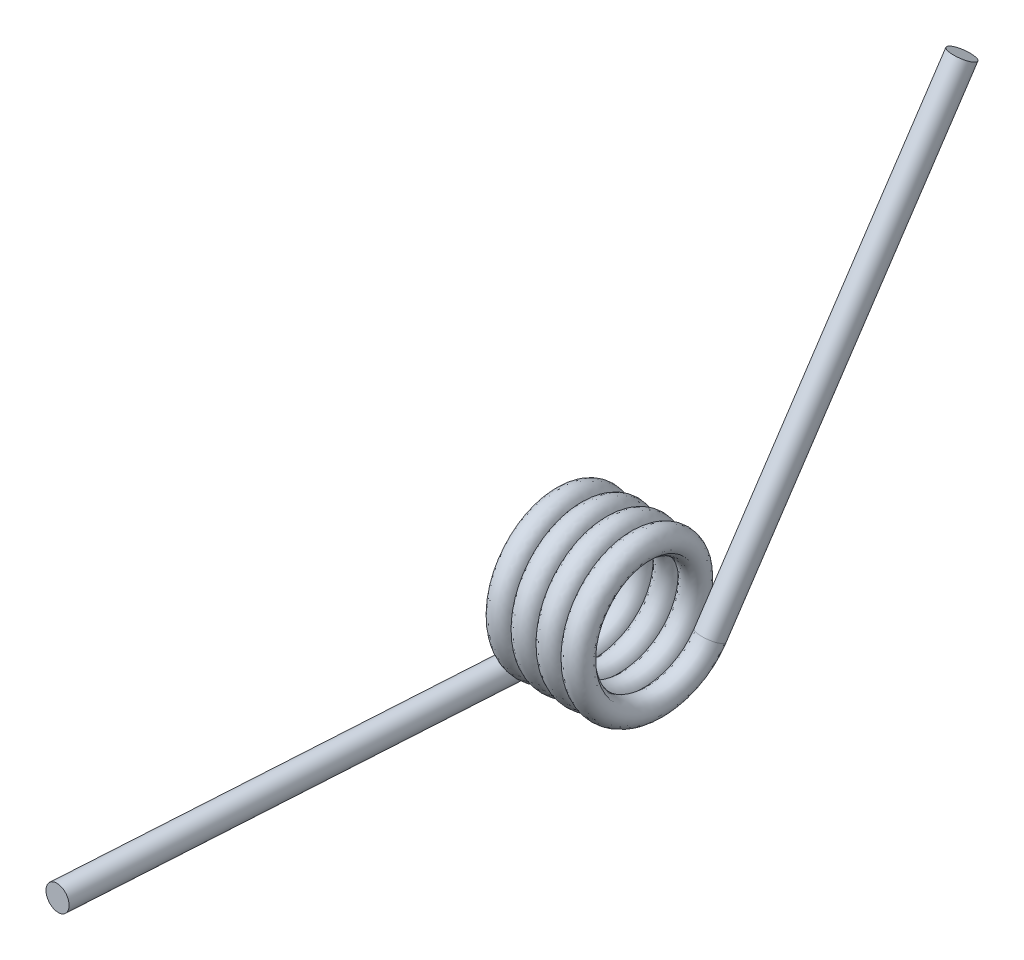
ISO-10303-21;
HEADER;
FILE_DESCRIPTION(('STEP AP214'),'2;1');
FILE_NAME('part.step','',(''),(''),'','','');
FILE_SCHEMA(('AUTOMOTIVE_DESIGN { 1 0 10303 214 1 1 1 1 }'));
ENDSEC;
DATA;
#1=APPLICATION_CONTEXT('core data for automotive mechanical design processes');
#2=APPLICATION_PROTOCOL_DEFINITION('international standard','automotive_design',2000,#1);
#3=PRODUCT_CONTEXT('',#1,'mechanical');
#4=PRODUCT('Part','Part','',(#3));
#5=PRODUCT_RELATED_PRODUCT_CATEGORY('part','',(#4));
#6=PRODUCT_DEFINITION_FORMATION('','',#4);
#7=PRODUCT_DEFINITION_CONTEXT('part definition',#1,'design');
#8=PRODUCT_DEFINITION('design','',#6,#7);
#9=PRODUCT_DEFINITION_SHAPE('','',#8);
#10=(LENGTH_UNIT() NAMED_UNIT(*) SI_UNIT(.MILLI.,.METRE.));
#11=(NAMED_UNIT(*) PLANE_ANGLE_UNIT() SI_UNIT($,.RADIAN.));
#12=(NAMED_UNIT(*) SI_UNIT($,.STERADIAN.) SOLID_ANGLE_UNIT());
#13=UNCERTAINTY_MEASURE_WITH_UNIT(LENGTH_MEASURE(1.E-05),#10,'distance_accuracy_value','');
#14=(GEOMETRIC_REPRESENTATION_CONTEXT(3) GLOBAL_UNCERTAINTY_ASSIGNED_CONTEXT((#13)) GLOBAL_UNIT_ASSIGNED_CONTEXT((#10,
#11,#12)) REPRESENTATION_CONTEXT('',''));
#15=CARTESIAN_POINT('',(0.,0.,0.));
#16=DIRECTION('',(0.,0.,1.));
#17=DIRECTION('',(1.,0.,0.));
#18=AXIS2_PLACEMENT_3D('',#15,#16,#17);
#19=CARTESIAN_POINT('',(-1.07746324253222,-5.6515,-0.0662813019784811));
#20=CARTESIAN_POINT('',(-0.895429909198887,-5.61323247246049,-3.32917634830365));
#21=CARTESIAN_POINT('',(-0.713396575865554,-2.76834870869073,-4.927483220477));
#22=CARTESIAN_POINT('',(-0.531363242532221,0.0765350550790295,-6.52579009265034));
#23=CARTESIAN_POINT('',(-0.349329909198888,2.88315129130927,-4.86120191849852));
#24=CARTESIAN_POINT('',(-0.167296575865555,5.68976752753952,-3.19661374434669));
#25=CARTESIAN_POINT('',(0.014736757467778,5.6515,0.0662813019784804));
#26=CARTESIAN_POINT('',(0.196770090801111,5.61323247246049,3.32917634830365));
#27=CARTESIAN_POINT('',(0.378803424134444,2.76834870869073,4.927483220477));
#28=CARTESIAN_POINT('',(0.560836757467777,-0.0765350550790287,6.52579009265034));
#29=CARTESIAN_POINT('',(0.74287009080111,-2.88315129130927,4.86120191849852));
#30=CARTESIAN_POINT('',(0.924903424134443,-5.68976752753952,3.19661374434669));
#31=CARTESIAN_POINT('',(1.10693675746778,-5.6515,-0.0662813019784811));
#32=CARTESIAN_POINT('',(1.28897009080111,-5.61323247246049,-3.32917634830365));
#33=CARTESIAN_POINT('',(1.47100342413444,-2.76834870869073,-4.927483220477));
#34=CARTESIAN_POINT('',(1.65303675746777,0.0765350550790295,-6.52579009265034));
#35=CARTESIAN_POINT('',(1.83507009080111,2.88315129130927,-4.86120191849852));
#36=CARTESIAN_POINT('',(2.01710342413444,5.68976752753952,-3.19661374434669));
#37=CARTESIAN_POINT('',(2.19913675746777,5.6515,0.0662813019784804));
#38=CARTESIAN_POINT('',(2.38117009080111,5.61323247246049,3.32917634830365));
#39=CARTESIAN_POINT('',(2.56320342413444,2.76834870869073,4.927483220477));
#40=CARTESIAN_POINT('',(2.74523675746777,-0.0765350550790287,6.52579009265034));
#41=CARTESIAN_POINT('',(2.9272700908011,-2.88315129130927,4.86120191849852));
#42=CARTESIAN_POINT('',(3.10930342413444,-5.68976752753952,3.19661374434669));
#43=CARTESIAN_POINT('',(3.29133675746777,-5.6515,-0.0662813019784811));
#44=CARTESIAN_POINT('',(3.4733700908011,-5.61323247246049,-3.32917634830365));
#45=CARTESIAN_POINT('',(3.65540342413444,-2.76834870869073,-4.927483220477));
#46=CARTESIAN_POINT('',(3.83743675746777,0.0765350550790295,-6.52579009265034));
#47=CARTESIAN_POINT('',(4.0194700908011,2.88315129130927,-4.86120191849852));
#48=CARTESIAN_POINT('',(4.20150342413443,5.68976752753952,-3.19661374434669));
#49=CARTESIAN_POINT('',(4.38353675746777,5.6515,0.0662813019784804));
#50=CARTESIAN_POINT('',(4.5655700908011,5.61323247246049,3.32917634830365));
#51=CARTESIAN_POINT('',(4.74760342413443,2.76834870869073,4.927483220477));
#52=CARTESIAN_POINT('',(4.92963675746777,-0.0765350550790287,6.52579009265034));
#53=CARTESIAN_POINT('',(5.1116700908011,-2.88315129130927,4.86120191849852));
#54=CARTESIAN_POINT('',(5.29370342413443,-5.68976752753952,3.19661374434669));
#55=CARTESIAN_POINT('',(5.47573675746777,-5.6515,-0.0662813019784811));
#56=CARTESIAN_POINT('',(5.6577700908011,-5.61323247246049,-3.32917634830365));
#57=CARTESIAN_POINT('',(5.83980342413443,-2.76834870869073,-4.927483220477));
#58=CARTESIAN_POINT('',(6.02183675746776,0.0765350550790295,-6.52579009265034));
#59=CARTESIAN_POINT('',(6.2038700908011,2.88315129130927,-4.86120191849852));
#60=CARTESIAN_POINT('',(6.38590342413443,5.68976752753952,-3.19661374434669));
#61=CARTESIAN_POINT('',(6.56793675746776,5.6515,0.0662813019784804));
#62=CARTESIAN_POINT('',(6.7499700908011,5.61323247246049,3.32917634830365));
#63=CARTESIAN_POINT('',(6.93200342413443,2.76834870869073,4.927483220477));
#64=CARTESIAN_POINT('',(7.11403675746776,-0.0765350550790287,6.52579009265034));
#65=CARTESIAN_POINT('',(7.29607009080109,-2.88315129130927,4.86120191849852));
#66=CARTESIAN_POINT('',(7.47810342413443,-5.68976752753952,3.19661374434669));
#67=CARTESIAN_POINT('',(7.66013675746776,-5.6515,-0.0662813019784811));
#68=CARTESIAN_POINT('',(7.84217009080109,-5.61323247246049,-3.32917634830365));
#69=CARTESIAN_POINT('',(8.02420342413443,-2.76834870869073,-4.927483220477));
#70=CARTESIAN_POINT('',(8.20623675746776,0.0765350550790295,-6.52579009265034));
#71=CARTESIAN_POINT('',(8.38827009080109,2.88315129130927,-4.86120191849852));
#72=CARTESIAN_POINT('',(8.57030342413443,5.68976752753952,-3.19661374434669));
#73=CARTESIAN_POINT('',(8.75233675746776,5.6515,0.0662813019784804));
#74=CARTESIAN_POINT('',(8.93437009080109,5.61323247246049,3.32917634830365));
#75=CARTESIAN_POINT('',(9.11640342413442,2.76834870869073,4.927483220477));
#76=CARTESIAN_POINT('',(9.29843675746776,-0.0765350550790287,6.52579009265034));
#77=CARTESIAN_POINT('',(9.48047009080109,-2.88315129130927,4.86120191849852));
#78=CARTESIAN_POINT('',(9.66250342413442,-5.68976752753952,3.19661374434669));
#79=CARTESIAN_POINT('',(9.84453675746776,-5.6515,-0.0662813019784811));
#80=CARTESIAN_POINT('',(-1.07746324253222,-3.4925,-0.066281301978456));
#81=CARTESIAN_POINT('',(-0.895429909198888,-3.4542324724605,-2.08267711712322));
#82=CARTESIAN_POINT('',(-0.713396575865555,-1.68884870869075,-3.05773437370638));
#83=CARTESIAN_POINT('',(-0.531363242532222,0.0765350550790006,-4.03279163028954));
#84=CARTESIAN_POINT('',(-0.349329909198889,1.80365129130925,-2.99145307172793));
#85=CARTESIAN_POINT('',(-0.167296575865557,3.5307675275395,-1.95011451316632));
#86=CARTESIAN_POINT('',(0.0147367574677764,3.4925,0.0662813019784555));
#87=CARTESIAN_POINT('',(0.196770090801109,3.4542324724605,2.08267711712322));
#88=CARTESIAN_POINT('',(0.378803424134442,1.68884870869075,3.05773437370638));
#89=CARTESIAN_POINT('',(0.560836757467775,-0.0765350550790001,4.03279163028954));
#90=CARTESIAN_POINT('',(0.742870090801108,-1.80365129130925,2.99145307172793));
#91=CARTESIAN_POINT('',(0.924903424134441,-3.5307675275395,1.95011451316632));
#92=CARTESIAN_POINT('',(1.10693675746777,-3.4925,-0.066281301978456));
#93=CARTESIAN_POINT('',(1.28897009080111,-3.4542324724605,-2.08267711712322));
#94=CARTESIAN_POINT('',(1.47100342413444,-1.68884870869075,-3.05773437370638));
#95=CARTESIAN_POINT('',(1.65303675746777,0.0765350550790006,-4.03279163028954));
#96=CARTESIAN_POINT('',(1.83507009080111,1.80365129130925,-2.99145307172793));
#97=CARTESIAN_POINT('',(2.01710342413444,3.5307675275395,-1.95011451316632));
#98=CARTESIAN_POINT('',(2.19913675746777,3.4925,0.0662813019784555));
#99=CARTESIAN_POINT('',(2.3811700908011,3.4542324724605,2.08267711712322));
#100=CARTESIAN_POINT('',(2.56320342413444,1.68884870869075,3.05773437370638));
#101=CARTESIAN_POINT('',(2.74523675746777,-0.0765350550790001,4.03279163028954));
#102=CARTESIAN_POINT('',(2.9272700908011,-1.80365129130925,2.99145307172793));
#103=CARTESIAN_POINT('',(3.10930342413444,-3.5307675275395,1.95011451316632));
#104=CARTESIAN_POINT('',(3.29133675746777,-3.4925,-0.066281301978456));
#105=CARTESIAN_POINT('',(3.4733700908011,-3.4542324724605,-2.08267711712322));
#106=CARTESIAN_POINT('',(3.65540342413444,-1.68884870869075,-3.05773437370638));
#107=CARTESIAN_POINT('',(3.83743675746777,0.0765350550790006,-4.03279163028954));
#108=CARTESIAN_POINT('',(4.0194700908011,1.80365129130925,-2.99145307172793));
#109=CARTESIAN_POINT('',(4.20150342413443,3.5307675275395,-1.95011451316632));
#110=CARTESIAN_POINT('',(4.38353675746777,3.4925,0.0662813019784555));
#111=CARTESIAN_POINT('',(4.5655700908011,3.4542324724605,2.08267711712322));
#112=CARTESIAN_POINT('',(4.74760342413443,1.68884870869075,3.05773437370638));
#113=CARTESIAN_POINT('',(4.92963675746777,-0.0765350550790001,4.03279163028954));
#114=CARTESIAN_POINT('',(5.1116700908011,-1.80365129130925,2.99145307172793));
#115=CARTESIAN_POINT('',(5.29370342413443,-3.5307675275395,1.95011451316632));
#116=CARTESIAN_POINT('',(5.47573675746776,-3.4925,-0.066281301978456));
#117=CARTESIAN_POINT('',(5.6577700908011,-3.4542324724605,-2.08267711712322));
#118=CARTESIAN_POINT('',(5.83980342413443,-1.68884870869075,-3.05773437370638));
#119=CARTESIAN_POINT('',(6.02183675746776,0.0765350550790006,-4.03279163028954));
#120=CARTESIAN_POINT('',(6.2038700908011,1.80365129130925,-2.99145307172793));
#121=CARTESIAN_POINT('',(6.38590342413443,3.5307675275395,-1.95011451316632));
#122=CARTESIAN_POINT('',(6.56793675746776,3.4925,0.0662813019784555));
#123=CARTESIAN_POINT('',(6.74997009080109,3.4542324724605,2.08267711712322));
#124=CARTESIAN_POINT('',(6.93200342413443,1.68884870869075,3.05773437370638));
#125=CARTESIAN_POINT('',(7.11403675746776,-0.0765350550790001,4.03279163028954));
#126=CARTESIAN_POINT('',(7.29607009080109,-1.80365129130925,2.99145307172793));
#127=CARTESIAN_POINT('',(7.47810342413443,-3.5307675275395,1.95011451316632));
#128=CARTESIAN_POINT('',(7.66013675746776,-3.4925,-0.066281301978456));
#129=CARTESIAN_POINT('',(7.84217009080109,-3.4542324724605,-2.08267711712322));
#130=CARTESIAN_POINT('',(8.02420342413443,-1.68884870869075,-3.05773437370638));
#131=CARTESIAN_POINT('',(8.20623675746776,0.0765350550790006,-4.03279163028954));
#132=CARTESIAN_POINT('',(8.38827009080109,1.80365129130925,-2.99145307172793));
#133=CARTESIAN_POINT('',(8.57030342413442,3.5307675275395,-1.95011451316632));
#134=CARTESIAN_POINT('',(8.75233675746776,3.4925,0.0662813019784555));
#135=CARTESIAN_POINT('',(8.93437009080109,3.4542324724605,2.08267711712322));
#136=CARTESIAN_POINT('',(9.11640342413442,1.68884870869075,3.05773437370638));
#137=CARTESIAN_POINT('',(9.29843675746775,-0.0765350550790001,4.03279163028954));
#138=CARTESIAN_POINT('',(9.48047009080109,-1.80365129130925,2.99145307172793));
#139=CARTESIAN_POINT('',(9.66250342413442,-3.5307675275395,1.95011451316632));
#140=CARTESIAN_POINT('',(9.84453675746775,-3.4925,-0.066281301978456));
#141=CARTESIAN_POINT('',(1.07746324253222,-3.4925,0.0662813019783878));
#142=CARTESIAN_POINT('',(1.25949657586555,-3.53076752753946,-1.95011451316638));
#143=CARTESIAN_POINT('',(1.44152990919888,-1.80365129130919,-2.99145307172796));
#144=CARTESIAN_POINT('',(1.62356324253222,-0.0765350550789224,-4.03279163028954));
#145=CARTESIAN_POINT('',(1.80559657586555,1.68884870869081,-3.05773437370635));
#146=CARTESIAN_POINT('',(1.98762990919888,3.45423247246054,-2.08267711712316));
#147=CARTESIAN_POINT('',(2.16966324253222,3.4925,-0.0662813019783882));
#148=CARTESIAN_POINT('',(2.35169657586555,3.53076752753946,1.95011451316638));
#149=CARTESIAN_POINT('',(2.53372990919888,1.80365129130919,2.99145307172796));
#150=CARTESIAN_POINT('',(2.71576324253221,0.0765350550789229,4.03279163028954));
#151=CARTESIAN_POINT('',(2.89779657586555,-1.68884870869081,3.05773437370635));
#152=CARTESIAN_POINT('',(3.07982990919888,-3.45423247246054,2.08267711712316));
#153=CARTESIAN_POINT('',(3.26186324253221,-3.4925,0.0662813019783878));
#154=CARTESIAN_POINT('',(3.44389657586555,-3.53076752753946,-1.95011451316638));
#155=CARTESIAN_POINT('',(3.62592990919888,-1.80365129130919,-2.99145307172796));
#156=CARTESIAN_POINT('',(3.80796324253221,-0.0765350550789224,-4.03279163028954));
#157=CARTESIAN_POINT('',(3.98999657586554,1.68884870869081,-3.05773437370635));
#158=CARTESIAN_POINT('',(4.17202990919888,3.45423247246054,-2.08267711712316));
#159=CARTESIAN_POINT('',(4.35406324253221,3.4925,-0.0662813019783882));
#160=CARTESIAN_POINT('',(4.53609657586554,3.53076752753946,1.95011451316638));
#161=CARTESIAN_POINT('',(4.71812990919888,1.80365129130919,2.99145307172796));
#162=CARTESIAN_POINT('',(4.90016324253221,0.0765350550789229,4.03279163028954));
#163=CARTESIAN_POINT('',(5.08219657586554,-1.68884870869081,3.05773437370635));
#164=CARTESIAN_POINT('',(5.26422990919888,-3.45423247246054,2.08267711712316));
#165=CARTESIAN_POINT('',(5.44626324253221,-3.4925,0.0662813019783878));
#166=CARTESIAN_POINT('',(5.62829657586554,-3.53076752753946,-1.95011451316638));
#167=CARTESIAN_POINT('',(5.81032990919887,-1.80365129130919,-2.99145307172796));
#168=CARTESIAN_POINT('',(5.99236324253221,-0.0765350550789224,-4.03279163028954));
#169=CARTESIAN_POINT('',(6.17439657586554,1.68884870869081,-3.05773437370635));
#170=CARTESIAN_POINT('',(6.35642990919887,3.45423247246054,-2.08267711712316));
#171=CARTESIAN_POINT('',(6.53846324253221,3.4925,-0.0662813019783882));
#172=CARTESIAN_POINT('',(6.72049657586554,3.53076752753946,1.95011451316638));
#173=CARTESIAN_POINT('',(6.90252990919887,1.80365129130919,2.99145307172796));
#174=CARTESIAN_POINT('',(7.08456324253221,0.0765350550789229,4.03279163028954));
#175=CARTESIAN_POINT('',(7.26659657586554,-1.68884870869081,3.05773437370635));
#176=CARTESIAN_POINT('',(7.44862990919887,-3.45423247246054,2.08267711712316));
#177=CARTESIAN_POINT('',(7.6306632425322,-3.4925,0.0662813019783878));
#178=CARTESIAN_POINT('',(7.81269657586554,-3.53076752753946,-1.95011451316638));
#179=CARTESIAN_POINT('',(7.99472990919887,-1.80365129130919,-2.99145307172796));
#180=CARTESIAN_POINT('',(8.1767632425322,-0.0765350550789224,-4.03279163028954));
#181=CARTESIAN_POINT('',(8.35879657586553,1.68884870869081,-3.05773437370635));
#182=CARTESIAN_POINT('',(8.54082990919887,3.45423247246054,-2.08267711712316));
#183=CARTESIAN_POINT('',(8.7228632425322,3.4925,-0.0662813019783882));
#184=CARTESIAN_POINT('',(8.90489657586553,3.53076752753946,1.95011451316638));
#185=CARTESIAN_POINT('',(9.08692990919887,1.80365129130919,2.99145307172796));
#186=CARTESIAN_POINT('',(9.2689632425322,0.0765350550789229,4.03279163028954));
#187=CARTESIAN_POINT('',(9.45099657586553,-1.68884870869081,3.05773437370635));
#188=CARTESIAN_POINT('',(9.63302990919886,-3.45423247246054,2.08267711712316));
#189=CARTESIAN_POINT('',(9.8150632425322,-3.4925,0.0662813019783878));
#190=CARTESIAN_POINT('',(9.99709657586553,-3.53076752753946,-1.95011451316638));
#191=CARTESIAN_POINT('',(10.1791299091989,-1.80365129130919,-2.99145307172796));
#192=CARTESIAN_POINT('',(10.3611632425322,-0.0765350550789224,-4.03279163028954));
#193=CARTESIAN_POINT('',(10.5431965758655,1.68884870869081,-3.05773437370635));
#194=CARTESIAN_POINT('',(10.7252299091989,3.45423247246054,-2.08267711712316));
#195=CARTESIAN_POINT('',(10.9072632425322,3.4925,-0.0662813019783882));
#196=CARTESIAN_POINT('',(11.0892965758655,3.53076752753946,1.95011451316638));
#197=CARTESIAN_POINT('',(11.2713299091989,1.80365129130919,2.99145307172796));
#198=CARTESIAN_POINT('',(11.4533632425322,0.0765350550789229,4.03279163028954));
#199=CARTESIAN_POINT('',(11.6353965758655,-1.68884870869081,3.05773437370635));
#200=CARTESIAN_POINT('',(11.8174299091989,-3.45423247246054,2.08267711712316));
#201=CARTESIAN_POINT('',(11.9994632425322,-3.4925,0.0662813019783878));
#202=CARTESIAN_POINT('',(1.07746324253222,-5.6515,0.0662813019783627));
#203=CARTESIAN_POINT('',(1.25949657586555,-5.68976752753945,-3.19661374434681));
#204=CARTESIAN_POINT('',(1.44152990919889,-2.88315129130917,-4.86120191849858));
#205=CARTESIAN_POINT('',(1.62356324253222,-0.0765350550788935,-6.52579009265034));
#206=CARTESIAN_POINT('',(1.80559657586555,2.76834870869083,-4.92748322047694));
#207=CARTESIAN_POINT('',(1.98762990919888,5.61323247246055,-3.32917634830354));
#208=CARTESIAN_POINT('',(2.16966324253222,5.6515,-0.0662813019783634));
#209=CARTESIAN_POINT('',(2.35169657586555,5.68976752753945,3.19661374434681));
#210=CARTESIAN_POINT('',(2.53372990919888,2.88315129130917,4.86120191849857));
#211=CARTESIAN_POINT('',(2.71576324253222,0.0765350550788943,6.52579009265034));
#212=CARTESIAN_POINT('',(2.89779657586555,-2.76834870869083,4.92748322047694));
#213=CARTESIAN_POINT('',(3.07982990919888,-5.61323247246055,3.32917634830354));
#214=CARTESIAN_POINT('',(3.26186324253222,-5.6515,0.0662813019783627));
#215=CARTESIAN_POINT('',(3.44389657586555,-5.68976752753945,-3.19661374434681));
#216=CARTESIAN_POINT('',(3.62592990919888,-2.88315129130917,-4.86120191849858));
#217=CARTESIAN_POINT('',(3.80796324253221,-0.0765350550788935,-6.52579009265034));
#218=CARTESIAN_POINT('',(3.98999657586555,2.76834870869083,-4.92748322047694));
#219=CARTESIAN_POINT('',(4.17202990919888,5.61323247246055,-3.32917634830354));
#220=CARTESIAN_POINT('',(4.35406324253221,5.6515,-0.0662813019783634));
#221=CARTESIAN_POINT('',(4.53609657586555,5.68976752753945,3.19661374434681));
#222=CARTESIAN_POINT('',(4.71812990919888,2.88315129130917,4.86120191849857));
#223=CARTESIAN_POINT('',(4.90016324253221,0.0765350550788943,6.52579009265034));
#224=CARTESIAN_POINT('',(5.08219657586554,-2.76834870869083,4.92748322047694));
#225=CARTESIAN_POINT('',(5.26422990919888,-5.61323247246055,3.32917634830354));
#226=CARTESIAN_POINT('',(5.44626324253221,-5.6515,0.0662813019783627));
#227=CARTESIAN_POINT('',(5.62829657586554,-5.68976752753945,-3.19661374434681));
#228=CARTESIAN_POINT('',(5.81032990919888,-2.88315129130917,-4.86120191849858));
#229=CARTESIAN_POINT('',(5.99236324253221,-0.0765350550788935,-6.52579009265034));
#230=CARTESIAN_POINT('',(6.17439657586554,2.76834870869083,-4.92748322047694));
#231=CARTESIAN_POINT('',(6.35642990919888,5.61323247246055,-3.32917634830354));
#232=CARTESIAN_POINT('',(6.53846324253221,5.6515,-0.0662813019783634));
#233=CARTESIAN_POINT('',(6.72049657586554,5.68976752753945,3.19661374434681));
#234=CARTESIAN_POINT('',(6.90252990919887,2.88315129130917,4.86120191849857));
#235=CARTESIAN_POINT('',(7.08456324253221,0.0765350550788943,6.52579009265034));
#236=CARTESIAN_POINT('',(7.26659657586554,-2.76834870869083,4.92748322047694));
#237=CARTESIAN_POINT('',(7.44862990919887,-5.61323247246055,3.32917634830354));
#238=CARTESIAN_POINT('',(7.63066324253221,-5.6515,0.0662813019783627));
#239=CARTESIAN_POINT('',(7.81269657586554,-5.68976752753945,-3.19661374434681));
#240=CARTESIAN_POINT('',(7.99472990919887,-2.88315129130917,-4.86120191849858));
#241=CARTESIAN_POINT('',(8.1767632425322,-0.0765350550788935,-6.52579009265034));
#242=CARTESIAN_POINT('',(8.35879657586554,2.76834870869083,-4.92748322047694));
#243=CARTESIAN_POINT('',(8.54082990919887,5.61323247246055,-3.32917634830354));
#244=CARTESIAN_POINT('',(8.7228632425322,5.6515,-0.0662813019783634));
#245=CARTESIAN_POINT('',(8.90489657586554,5.68976752753945,3.19661374434681));
#246=CARTESIAN_POINT('',(9.08692990919887,2.88315129130917,4.86120191849857));
#247=CARTESIAN_POINT('',(9.2689632425322,0.0765350550788943,6.52579009265034));
#248=CARTESIAN_POINT('',(9.45099657586553,-2.76834870869083,4.92748322047694));
#249=CARTESIAN_POINT('',(9.63302990919887,-5.61323247246055,3.32917634830354));
#250=CARTESIAN_POINT('',(9.8150632425322,-5.6515,0.0662813019783627));
#251=CARTESIAN_POINT('',(9.99709657586553,-5.68976752753945,-3.19661374434681));
#252=CARTESIAN_POINT('',(10.1791299091989,-2.88315129130917,-4.86120191849858));
#253=CARTESIAN_POINT('',(10.3611632425322,-0.0765350550788935,-6.52579009265034));
#254=CARTESIAN_POINT('',(10.5431965758655,2.76834870869083,-4.92748322047694));
#255=CARTESIAN_POINT('',(10.7252299091989,5.61323247246055,-3.32917634830354));
#256=CARTESIAN_POINT('',(10.9072632425322,5.6515,-0.0662813019783634));
#257=CARTESIAN_POINT('',(11.0892965758655,5.68976752753945,3.19661374434681));
#258=CARTESIAN_POINT('',(11.2713299091989,2.88315129130917,4.86120191849857));
#259=CARTESIAN_POINT('',(11.4533632425322,0.0765350550788943,6.52579009265034));
#260=CARTESIAN_POINT('',(11.6353965758655,-2.76834870869083,4.92748322047694));
#261=CARTESIAN_POINT('',(11.8174299091989,-5.61323247246055,3.32917634830354));
#262=CARTESIAN_POINT('',(11.9994632425322,-5.6515,0.0662813019783627));
#263=CARTESIAN_POINT('',(1.07746324253222,-7.8105,0.0662813019783376));
#264=CARTESIAN_POINT('',(1.25949657586555,-7.84876752753943,-4.44311297552723));
#265=CARTESIAN_POINT('',(1.44152990919889,-3.96265129130915,-6.73095076526919));
#266=CARTESIAN_POINT('',(1.62356324253222,-0.0765350550788647,-9.01878855501115));
#267=CARTESIAN_POINT('',(1.80559657586555,3.84784870869085,-6.79723206724753));
#268=CARTESIAN_POINT('',(1.98762990919889,7.77223247246057,-4.57567557948391));
#269=CARTESIAN_POINT('',(2.16966324253222,7.8105,-0.0662813019783385));
#270=CARTESIAN_POINT('',(2.35169657586555,7.84876752753943,4.44311297552723));
#271=CARTESIAN_POINT('',(2.53372990919888,3.96265129130915,6.73095076526919));
#272=CARTESIAN_POINT('',(2.71576324253222,0.0765350550788658,9.01878855501115));
#273=CARTESIAN_POINT('',(2.89779657586555,-3.84784870869085,6.79723206724753));
#274=CARTESIAN_POINT('',(3.07982990919888,-7.77223247246057,4.57567557948392));
#275=CARTESIAN_POINT('',(3.26186324253222,-7.8105,0.0662813019783376));
#276=CARTESIAN_POINT('',(3.44389657586555,-7.84876752753943,-4.44311297552723));
#277=CARTESIAN_POINT('',(3.62592990919888,-3.96265129130915,-6.73095076526919));
#278=CARTESIAN_POINT('',(3.80796324253221,-0.0765350550788647,-9.01878855501115));
#279=CARTESIAN_POINT('',(3.98999657586555,3.84784870869085,-6.79723206724753));
#280=CARTESIAN_POINT('',(4.17202990919888,7.77223247246057,-4.57567557948391));
#281=CARTESIAN_POINT('',(4.35406324253221,7.8105,-0.0662813019783385));
#282=CARTESIAN_POINT('',(4.53609657586555,7.84876752753943,4.44311297552723));
#283=CARTESIAN_POINT('',(4.71812990919888,3.96265129130915,6.73095076526919));
#284=CARTESIAN_POINT('',(4.90016324253221,0.0765350550788658,9.01878855501115));
#285=CARTESIAN_POINT('',(5.08219657586555,-3.84784870869085,6.79723206724753));
#286=CARTESIAN_POINT('',(5.26422990919888,-7.77223247246057,4.57567557948392));
#287=CARTESIAN_POINT('',(5.44626324253221,-7.8105,0.0662813019783376));
#288=CARTESIAN_POINT('',(5.62829657586555,-7.84876752753943,-4.44311297552723));
#289=CARTESIAN_POINT('',(5.81032990919888,-3.96265129130915,-6.73095076526919));
#290=CARTESIAN_POINT('',(5.99236324253221,-0.0765350550788647,-9.01878855501115));
#291=CARTESIAN_POINT('',(6.17439657586554,3.84784870869085,-6.79723206724753));
#292=CARTESIAN_POINT('',(6.35642990919888,7.77223247246057,-4.57567557948391));
#293=CARTESIAN_POINT('',(6.53846324253221,7.8105,-0.0662813019783385));
#294=CARTESIAN_POINT('',(6.72049657586554,7.84876752753943,4.44311297552723));
#295=CARTESIAN_POINT('',(6.90252990919887,3.96265129130915,6.73095076526919));
#296=CARTESIAN_POINT('',(7.08456324253221,0.0765350550788658,9.01878855501115));
#297=CARTESIAN_POINT('',(7.26659657586554,-3.84784870869085,6.79723206724753));
#298=CARTESIAN_POINT('',(7.44862990919887,-7.77223247246057,4.57567557948392));
#299=CARTESIAN_POINT('',(7.63066324253221,-7.8105,0.0662813019783376));
#300=CARTESIAN_POINT('',(7.81269657586554,-7.84876752753943,-4.44311297552723));
#301=CARTESIAN_POINT('',(7.99472990919887,-3.96265129130915,-6.73095076526919));
#302=CARTESIAN_POINT('',(8.17676324253221,-0.0765350550788647,-9.01878855501115));
#303=CARTESIAN_POINT('',(8.35879657586554,3.84784870869085,-6.79723206724753));
#304=CARTESIAN_POINT('',(8.54082990919887,7.77223247246057,-4.57567557948391));
#305=CARTESIAN_POINT('',(8.7228632425322,7.8105,-0.0662813019783385));
#306=CARTESIAN_POINT('',(8.90489657586554,7.84876752753943,4.44311297552723));
#307=CARTESIAN_POINT('',(9.08692990919887,3.96265129130915,6.73095076526919));
#308=CARTESIAN_POINT('',(9.2689632425322,0.0765350550788658,9.01878855501115));
#309=CARTESIAN_POINT('',(9.45099657586553,-3.84784870869085,6.79723206724753));
#310=CARTESIAN_POINT('',(9.63302990919887,-7.77223247246057,4.57567557948392));
#311=CARTESIAN_POINT('',(9.8150632425322,-7.8105,0.0662813019783376));
#312=CARTESIAN_POINT('',(9.99709657586553,-7.84876752753943,-4.44311297552723));
#313=CARTESIAN_POINT('',(10.1791299091989,-3.96265129130915,-6.73095076526919));
#314=CARTESIAN_POINT('',(10.3611632425322,-0.0765350550788647,-9.01878855501115));
#315=CARTESIAN_POINT('',(10.5431965758655,3.84784870869085,-6.79723206724753));
#316=CARTESIAN_POINT('',(10.7252299091989,7.77223247246057,-4.57567557948391));
#317=CARTESIAN_POINT('',(10.9072632425322,7.8105,-0.0662813019783385));
#318=CARTESIAN_POINT('',(11.0892965758655,7.84876752753943,4.44311297552723));
#319=CARTESIAN_POINT('',(11.2713299091989,3.96265129130915,6.73095076526919));
#320=CARTESIAN_POINT('',(11.4533632425322,0.0765350550788658,9.01878855501115));
#321=CARTESIAN_POINT('',(11.6353965758655,-3.84784870869085,6.79723206724753));
#322=CARTESIAN_POINT('',(11.8174299091989,-7.77223247246057,4.57567557948392));
#323=CARTESIAN_POINT('',(11.9994632425322,-7.8105,0.0662813019783376));
#324=CARTESIAN_POINT('',(-1.07746324253222,-7.8105,-0.0662813019785062));
#325=CARTESIAN_POINT('',(-0.895429909198885,-7.77223247246047,-4.57567557948408));
#326=CARTESIAN_POINT('',(-0.713396575865552,-3.84784870869071,-6.79723206724761));
#327=CARTESIAN_POINT('',(-0.531363242532219,0.0765350550790583,-9.01878855501115));
#328=CARTESIAN_POINT('',(-0.349329909198886,3.96265129130929,-6.73095076526911));
#329=CARTESIAN_POINT('',(-0.167296575865554,7.84876752753953,-4.44311297552707));
#330=CARTESIAN_POINT('',(0.0147367574677795,7.8105,0.0662813019785052));
#331=CARTESIAN_POINT('',(0.196770090801112,7.77223247246047,4.57567557948408));
#332=CARTESIAN_POINT('',(0.378803424134445,3.84784870869071,6.79723206724761));
#333=CARTESIAN_POINT('',(0.560836757467778,-0.0765350550790572,9.01878855501115));
#334=CARTESIAN_POINT('',(0.742870090801111,-3.96265129130929,6.73095076526911));
#335=CARTESIAN_POINT('',(0.924903424134444,-7.84876752753953,4.44311297552707));
#336=CARTESIAN_POINT('',(1.10693675746778,-7.8105,-0.0662813019785062));
#337=CARTESIAN_POINT('',(1.28897009080111,-7.77223247246047,-4.57567557948408));
#338=CARTESIAN_POINT('',(1.47100342413444,-3.84784870869071,-6.79723206724761));
#339=CARTESIAN_POINT('',(1.65303675746778,0.0765350550790583,-9.01878855501115));
#340=CARTESIAN_POINT('',(1.83507009080111,3.96265129130929,-6.73095076526911));
#341=CARTESIAN_POINT('',(2.01710342413444,7.84876752753953,-4.44311297552707));
#342=CARTESIAN_POINT('',(2.19913675746777,7.8105,0.0662813019785052));
#343=CARTESIAN_POINT('',(2.38117009080111,7.77223247246047,4.57567557948408));
#344=CARTESIAN_POINT('',(2.56320342413444,3.84784870869071,6.79723206724761));
#345=CARTESIAN_POINT('',(2.74523675746777,-0.0765350550790572,9.01878855501115));
#346=CARTESIAN_POINT('',(2.92727009080111,-3.96265129130929,6.73095076526911));
#347=CARTESIAN_POINT('',(3.10930342413444,-7.84876752753953,4.44311297552707));
#348=CARTESIAN_POINT('',(3.29133675746777,-7.8105,-0.0662813019785062));
#349=CARTESIAN_POINT('',(3.47337009080111,-7.77223247246047,-4.57567557948408));
#350=CARTESIAN_POINT('',(3.65540342413444,-3.84784870869071,-6.79723206724761));
#351=CARTESIAN_POINT('',(3.83743675746777,0.0765350550790583,-9.01878855501115));
#352=CARTESIAN_POINT('',(4.0194700908011,3.96265129130929,-6.73095076526911));
#353=CARTESIAN_POINT('',(4.20150342413444,7.84876752753953,-4.44311297552707));
#354=CARTESIAN_POINT('',(4.38353675746777,7.8105,0.0662813019785052));
#355=CARTESIAN_POINT('',(4.5655700908011,7.77223247246047,4.57567557948408));
#356=CARTESIAN_POINT('',(4.74760342413444,3.84784870869071,6.79723206724761));
#357=CARTESIAN_POINT('',(4.92963675746777,-0.0765350550790572,9.01878855501115));
#358=CARTESIAN_POINT('',(5.1116700908011,-3.96265129130929,6.73095076526911));
#359=CARTESIAN_POINT('',(5.29370342413443,-7.84876752753953,4.44311297552707));
#360=CARTESIAN_POINT('',(5.47573675746777,-7.8105,-0.0662813019785062));
#361=CARTESIAN_POINT('',(5.6577700908011,-7.77223247246047,-4.57567557948408));
#362=CARTESIAN_POINT('',(5.83980342413443,-3.84784870869071,-6.79723206724761));
#363=CARTESIAN_POINT('',(6.02183675746777,0.0765350550790583,-9.01878855501115));
#364=CARTESIAN_POINT('',(6.2038700908011,3.96265129130929,-6.73095076526911));
#365=CARTESIAN_POINT('',(6.38590342413443,7.84876752753953,-4.44311297552707));
#366=CARTESIAN_POINT('',(6.56793675746777,7.8105,0.0662813019785052));
#367=CARTESIAN_POINT('',(6.7499700908011,7.77223247246047,4.57567557948408));
#368=CARTESIAN_POINT('',(6.93200342413443,3.84784870869071,6.79723206724761));
#369=CARTESIAN_POINT('',(7.11403675746776,-0.0765350550790572,9.01878855501115));
#370=CARTESIAN_POINT('',(7.2960700908011,-3.96265129130929,6.73095076526911));
#371=CARTESIAN_POINT('',(7.47810342413443,-7.84876752753953,4.44311297552707));
#372=CARTESIAN_POINT('',(7.66013675746776,-7.8105,-0.0662813019785062));
#373=CARTESIAN_POINT('',(7.8421700908011,-7.77223247246047,-4.57567557948408));
#374=CARTESIAN_POINT('',(8.02420342413443,-3.84784870869071,-6.79723206724761));
#375=CARTESIAN_POINT('',(8.20623675746776,0.0765350550790583,-9.01878855501115));
#376=CARTESIAN_POINT('',(8.38827009080109,3.96265129130929,-6.73095076526911));
#377=CARTESIAN_POINT('',(8.57030342413443,7.84876752753953,-4.44311297552707));
#378=CARTESIAN_POINT('',(8.75233675746776,7.8105,0.0662813019785052));
#379=CARTESIAN_POINT('',(8.93437009080109,7.77223247246047,4.57567557948408));
#380=CARTESIAN_POINT('',(9.11640342413442,3.84784870869071,6.79723206724761));
#381=CARTESIAN_POINT('',(9.29843675746776,-0.0765350550790572,9.01878855501115));
#382=CARTESIAN_POINT('',(9.48047009080109,-3.96265129130929,6.73095076526911));
#383=CARTESIAN_POINT('',(9.66250342413442,-7.84876752753953,4.44311297552707));
#384=CARTESIAN_POINT('',(9.84453675746776,-7.8105,-0.0662813019785062));
#385=CARTESIAN_POINT('',(-1.07746324253222,-5.6515,-0.0662813019784811));
#386=CARTESIAN_POINT('',(-0.895429909198887,-5.61323247246049,-3.32917634830365));
#387=CARTESIAN_POINT('',(-0.713396575865554,-2.76834870869073,-4.927483220477));
#388=CARTESIAN_POINT('',(-0.531363242532221,0.0765350550790295,-6.52579009265034));
#389=CARTESIAN_POINT('',(-0.349329909198888,2.88315129130927,-4.86120191849852));
#390=CARTESIAN_POINT('',(-0.167296575865555,5.68976752753952,-3.19661374434669));
#391=CARTESIAN_POINT('',(0.014736757467778,5.6515,0.0662813019784804));
#392=CARTESIAN_POINT('',(0.196770090801111,5.61323247246049,3.32917634830365));
#393=CARTESIAN_POINT('',(0.378803424134444,2.76834870869073,4.927483220477));
#394=CARTESIAN_POINT('',(0.560836757467777,-0.0765350550790287,6.52579009265034));
#395=CARTESIAN_POINT('',(0.74287009080111,-2.88315129130927,4.86120191849852));
#396=CARTESIAN_POINT('',(0.924903424134443,-5.68976752753952,3.19661374434669));
#397=CARTESIAN_POINT('',(1.10693675746778,-5.6515,-0.0662813019784811));
#398=CARTESIAN_POINT('',(1.28897009080111,-5.61323247246049,-3.32917634830365));
#399=CARTESIAN_POINT('',(1.47100342413444,-2.76834870869073,-4.927483220477));
#400=CARTESIAN_POINT('',(1.65303675746777,0.0765350550790295,-6.52579009265034));
#401=CARTESIAN_POINT('',(1.83507009080111,2.88315129130927,-4.86120191849852));
#402=CARTESIAN_POINT('',(2.01710342413444,5.68976752753952,-3.19661374434669));
#403=CARTESIAN_POINT('',(2.19913675746777,5.6515,0.0662813019784804));
#404=CARTESIAN_POINT('',(2.38117009080111,5.61323247246049,3.32917634830365));
#405=CARTESIAN_POINT('',(2.56320342413444,2.76834870869073,4.927483220477));
#406=CARTESIAN_POINT('',(2.74523675746777,-0.0765350550790287,6.52579009265034));
#407=CARTESIAN_POINT('',(2.9272700908011,-2.88315129130927,4.86120191849852));
#408=CARTESIAN_POINT('',(3.10930342413444,-5.68976752753952,3.19661374434669));
#409=CARTESIAN_POINT('',(3.29133675746777,-5.6515,-0.0662813019784811));
#410=CARTESIAN_POINT('',(3.4733700908011,-5.61323247246049,-3.32917634830365));
#411=CARTESIAN_POINT('',(3.65540342413444,-2.76834870869073,-4.927483220477));
#412=CARTESIAN_POINT('',(3.83743675746777,0.0765350550790295,-6.52579009265034));
#413=CARTESIAN_POINT('',(4.0194700908011,2.88315129130927,-4.86120191849852));
#414=CARTESIAN_POINT('',(4.20150342413443,5.68976752753952,-3.19661374434669));
#415=CARTESIAN_POINT('',(4.38353675746777,5.6515,0.0662813019784804));
#416=CARTESIAN_POINT('',(4.5655700908011,5.61323247246049,3.32917634830365));
#417=CARTESIAN_POINT('',(4.74760342413443,2.76834870869073,4.927483220477));
#418=CARTESIAN_POINT('',(4.92963675746777,-0.0765350550790287,6.52579009265034));
#419=CARTESIAN_POINT('',(5.1116700908011,-2.88315129130927,4.86120191849852));
#420=CARTESIAN_POINT('',(5.29370342413443,-5.68976752753952,3.19661374434669));
#421=CARTESIAN_POINT('',(5.47573675746777,-5.6515,-0.0662813019784811));
#422=CARTESIAN_POINT('',(5.6577700908011,-5.61323247246049,-3.32917634830365));
#423=CARTESIAN_POINT('',(5.83980342413443,-2.76834870869073,-4.927483220477));
#424=CARTESIAN_POINT('',(6.02183675746776,0.0765350550790295,-6.52579009265034));
#425=CARTESIAN_POINT('',(6.2038700908011,2.88315129130927,-4.86120191849852));
#426=CARTESIAN_POINT('',(6.38590342413443,5.68976752753952,-3.19661374434669));
#427=CARTESIAN_POINT('',(6.56793675746776,5.6515,0.0662813019784804));
#428=CARTESIAN_POINT('',(6.7499700908011,5.61323247246049,3.32917634830365));
#429=CARTESIAN_POINT('',(6.93200342413443,2.76834870869073,4.927483220477));
#430=CARTESIAN_POINT('',(7.11403675746776,-0.0765350550790287,6.52579009265034));
#431=CARTESIAN_POINT('',(7.29607009080109,-2.88315129130927,4.86120191849852));
#432=CARTESIAN_POINT('',(7.47810342413443,-5.68976752753952,3.19661374434669));
#433=CARTESIAN_POINT('',(7.66013675746776,-5.6515,-0.0662813019784811));
#434=CARTESIAN_POINT('',(7.84217009080109,-5.61323247246049,-3.32917634830365));
#435=CARTESIAN_POINT('',(8.02420342413443,-2.76834870869073,-4.927483220477));
#436=CARTESIAN_POINT('',(8.20623675746776,0.0765350550790295,-6.52579009265034));
#437=CARTESIAN_POINT('',(8.38827009080109,2.88315129130927,-4.86120191849852));
#438=CARTESIAN_POINT('',(8.57030342413443,5.68976752753952,-3.19661374434669));
#439=CARTESIAN_POINT('',(8.75233675746776,5.6515,0.0662813019784804));
#440=CARTESIAN_POINT('',(8.93437009080109,5.61323247246049,3.32917634830365));
#441=CARTESIAN_POINT('',(9.11640342413442,2.76834870869073,4.927483220477));
#442=CARTESIAN_POINT('',(9.29843675746776,-0.0765350550790287,6.52579009265034));
#443=CARTESIAN_POINT('',(9.48047009080109,-2.88315129130927,4.86120191849852));
#444=CARTESIAN_POINT('',(9.66250342413442,-5.68976752753952,3.19661374434669));
#445=CARTESIAN_POINT('',(9.84453675746776,-5.6515,-0.0662813019784811));
#446=(BOUNDED_SURFACE() B_SPLINE_SURFACE(3,2,((#19,#20,#21,#22,#23,#24,#25,#26,#27,#28,#29,#30,
#31,#32,#33,#34,#35,#36,#37,#38,#39,#40,#41,#42,#43,#44,#45,#46,#47,#48,#49,#50,#51,#52,#53,#54,
#55,#56,#57,#58,#59,#60,#61,#62,#63,#64,#65,#66,#67,#68,#69,#70,#71,#72,#73,#74,#75,#76,#77,#78,
#79),(#80,#81,#82,#83,#84,#85,#86,#87,#88,#89,#90,#91,#92,#93,#94,#95,#96,#97,#98,#99,#100,#101,
#102,#103,#104,#105,#106,#107,#108,#109,#110,#111,#112,#113,#114,#115,#116,#117,#118,#119,#120,
#121,#122,#123,#124,#125,#126,#127,#128,#129,#130,#131,#132,#133,#134,#135,#136,#137,#138,#139,
#140),(#141,#142,#143,#144,#145,#146,#147,#148,#149,#150,#151,#152,#153,#154,#155,#156,#157,
#158,#159,#160,#161,#162,#163,#164,#165,#166,#167,#168,#169,#170,#171,#172,#173,#174,#175,#176,
#177,#178,#179,#180,#181,#182,#183,#184,#185,#186,#187,#188,#189,#190,#191,#192,#193,#194,#195,
#196,#197,#198,#199,#200,#201),(#202,#203,#204,#205,#206,#207,#208,#209,#210,#211,#212,#213,
#214,#215,#216,#217,#218,#219,#220,#221,#222,#223,#224,#225,#226,#227,#228,#229,#230,#231,#232,
#233,#234,#235,#236,#237,#238,#239,#240,#241,#242,#243,#244,#245,#246,#247,#248,#249,#250,#251,
#252,#253,#254,#255,#256,#257,#258,#259,#260,#261,#262),(#263,#264,#265,#266,#267,#268,#269,
#270,#271,#272,#273,#274,#275,#276,#277,#278,#279,#280,#281,#282,#283,#284,#285,#286,#287,#288,
#289,#290,#291,#292,#293,#294,#295,#296,#297,#298,#299,#300,#301,#302,#303,#304,#305,#306,#307,
#308,#309,#310,#311,#312,#313,#314,#315,#316,#317,#318,#319,#320,#321,#322,#323),(#324,#325,
#326,#327,#328,#329,#330,#331,#332,#333,#334,#335,#336,#337,#338,#339,#340,#341,#342,#343,#344,
#345,#346,#347,#348,#349,#350,#351,#352,#353,#354,#355,#356,#357,#358,#359,#360,#361,#362,#363,
#364,#365,#366,#367,#368,#369,#370,#371,#372,#373,#374,#375,#376,#377,#378,#379,#380,#381,#382,
#383,#384),(#385,#386,#387,#388,#389,#390,#391,#392,#393,#394,#395,#396,#397,#398,#399,#400,
#401,#402,#403,#404,#405,#406,#407,#408,#409,#410,#411,#412,#413,#414,#415,#416,#417,#418,#419,
#420,#421,#422,#423,#424,#425,#426,#427,#428,#429,#430,#431,#432,#433,#434,#435,#436,#437,#438,
#439,#440,#441,#442,#443,#444,#445)),.UNSPECIFIED.,.T.,.F.,.F.) B_SPLINE_SURFACE_WITH_KNOTS((4,
3,4),(3,2,2,2,2,2,2,2,2,2,2,2,2,2,2,2,2,2,2,2,2,2,2,2,2,2,2,2,2,2,3),(0.,0.5,1.),(0.,
0.0333333333333333,0.0666666666666667,0.1,0.133333333333333,0.166666666666667,0.2,
0.233333333333333,0.266666666666667,0.3,0.333333333333333,0.366666666666667,0.4,
0.433333333333333,0.466666666666667,0.5,0.533333333333333,0.566666666666667,0.6,
0.633333333333333,0.666666666666667,0.7,0.733333333333333,0.766666666666667,0.8,
0.833333333333333,0.866666666666667,0.9,0.933333333333333,0.966666666666667,1.),
.UNSPECIFIED.) GEOMETRIC_REPRESENTATION_ITEM() RATIONAL_B_SPLINE_SURFACE(((1.,0.866025403784439,
1.,0.866025403784439,1.,0.866025403784439,1.,0.866025403784439,1.,0.866025403784439,1.,
0.866025403784439,1.,0.866025403784439,1.,0.866025403784439,1.,0.866025403784439,1.,
0.866025403784439,1.,0.866025403784439,1.,0.866025403784439,1.,0.866025403784439,1.,
0.866025403784439,1.,0.866025403784439,1.,0.866025403784439,1.,0.866025403784439,1.,
0.866025403784439,1.,0.866025403784439,1.,0.866025403784439,1.,0.866025403784439,1.,
0.866025403784439,1.,0.866025403784439,1.,0.866025403784439,1.,0.866025403784439,1.,
0.866025403784439,1.,0.866025403784439,1.,0.866025403784439,1.,0.866025403784439,1.,
0.866025403784439,1.),(0.333333333333333,0.288675134594813,0.333333333333333,0.288675134594813,
0.333333333333333,0.288675134594813,0.333333333333333,0.288675134594813,0.333333333333333,
0.288675134594813,0.333333333333333,0.288675134594813,0.333333333333333,0.288675134594813,
0.333333333333333,0.288675134594813,0.333333333333333,0.288675134594813,0.333333333333333,
0.288675134594813,0.333333333333333,0.288675134594813,0.333333333333333,0.288675134594813,
0.333333333333333,0.288675134594813,0.333333333333333,0.288675134594813,0.333333333333333,
0.288675134594813,0.333333333333333,0.288675134594813,0.333333333333333,0.288675134594813,
0.333333333333333,0.288675134594813,0.333333333333333,0.288675134594813,0.333333333333333,
0.288675134594813,0.333333333333333,0.288675134594813,0.333333333333333,0.288675134594813,
0.333333333333333,0.288675134594813,0.333333333333333,0.288675134594813,0.333333333333333,
0.288675134594813,0.333333333333333,0.288675134594813,0.333333333333333,0.288675134594813,
0.333333333333333,0.288675134594813,0.333333333333333,0.288675134594813,0.333333333333333,
0.288675134594813,0.333333333333333),(0.333333333333333,0.288675134594813,0.333333333333333,
0.288675134594813,0.333333333333333,0.288675134594813,0.333333333333333,0.288675134594813,
0.333333333333333,0.288675134594813,0.333333333333333,0.288675134594813,0.333333333333333,
0.288675134594813,0.333333333333333,0.288675134594813,0.333333333333333,0.288675134594813,
0.333333333333333,0.288675134594813,0.333333333333333,0.288675134594813,0.333333333333333,
0.288675134594813,0.333333333333333,0.288675134594813,0.333333333333333,0.288675134594813,
0.333333333333333,0.288675134594813,0.333333333333333,0.288675134594813,0.333333333333333,
0.288675134594813,0.333333333333333,0.288675134594813,0.333333333333333,0.288675134594813,
0.333333333333333,0.288675134594813,0.333333333333333,0.288675134594813,0.333333333333333,
0.288675134594813,0.333333333333333,0.288675134594813,0.333333333333333,0.288675134594813,
0.333333333333333,0.288675134594813,0.333333333333333,0.288675134594813,0.333333333333333,
0.288675134594813,0.333333333333333,0.288675134594813,0.333333333333333,0.288675134594813,
0.333333333333333,0.288675134594813,0.333333333333333),(1.,0.866025403784439,1.,
0.866025403784439,1.,0.866025403784439,1.,0.866025403784439,1.,0.866025403784439,1.,
0.866025403784439,1.,0.866025403784439,1.,0.866025403784439,1.,0.866025403784439,1.,
0.866025403784439,1.,0.866025403784439,1.,0.866025403784439,1.,0.866025403784439,1.,
0.866025403784439,1.,0.866025403784439,1.,0.866025403784439,1.,0.866025403784439,1.,
0.866025403784439,1.,0.866025403784439,1.,0.866025403784439,1.,0.866025403784439,1.,
0.866025403784439,1.,0.866025403784439,1.,0.866025403784439,1.,0.866025403784439,1.,
0.866025403784439,1.,0.866025403784439,1.,0.866025403784439,1.,0.866025403784439,1.,
0.866025403784439,1.),(0.333333333333333,0.288675134594813,0.333333333333333,0.288675134594813,
0.333333333333333,0.288675134594813,0.333333333333333,0.288675134594813,0.333333333333333,
0.288675134594813,0.333333333333333,0.288675134594813,0.333333333333333,0.288675134594813,
0.333333333333333,0.288675134594813,0.333333333333333,0.288675134594813,0.333333333333333,
0.288675134594813,0.333333333333333,0.288675134594813,0.333333333333333,0.288675134594813,
0.333333333333333,0.288675134594813,0.333333333333333,0.288675134594813,0.333333333333333,
0.288675134594813,0.333333333333333,0.288675134594813,0.333333333333333,0.288675134594813,
0.333333333333333,0.288675134594813,0.333333333333333,0.288675134594813,0.333333333333333,
0.288675134594813,0.333333333333333,0.288675134594813,0.333333333333333,0.288675134594813,
0.333333333333333,0.288675134594813,0.333333333333333,0.288675134594813,0.333333333333333,
0.288675134594813,0.333333333333333,0.288675134594813,0.333333333333333,0.288675134594813,
0.333333333333333,0.288675134594813,0.333333333333333,0.288675134594813,0.333333333333333,
0.288675134594813,0.333333333333333),(0.333333333333333,0.288675134594813,0.333333333333333,
0.288675134594813,0.333333333333333,0.288675134594813,0.333333333333333,0.288675134594813,
0.333333333333333,0.288675134594813,0.333333333333333,0.288675134594813,0.333333333333333,
0.288675134594813,0.333333333333333,0.288675134594813,0.333333333333333,0.288675134594813,
0.333333333333333,0.288675134594813,0.333333333333333,0.288675134594813,0.333333333333333,
0.288675134594813,0.333333333333333,0.288675134594813,0.333333333333333,0.288675134594813,
0.333333333333333,0.288675134594813,0.333333333333333,0.288675134594813,0.333333333333333,
0.288675134594813,0.333333333333333,0.288675134594813,0.333333333333333,0.288675134594813,
0.333333333333333,0.288675134594813,0.333333333333333,0.288675134594813,0.333333333333333,
0.288675134594813,0.333333333333333,0.288675134594813,0.333333333333333,0.288675134594813,
0.333333333333333,0.288675134594813,0.333333333333333,0.288675134594813,0.333333333333333,
0.288675134594813,0.333333333333333,0.288675134594813,0.333333333333333,0.288675134594813,
0.333333333333333,0.288675134594813,0.333333333333333),(1.,0.866025403784439,1.,
0.866025403784439,1.,0.866025403784439,1.,0.866025403784439,1.,0.866025403784439,1.,
0.866025403784439,1.,0.866025403784439,1.,0.866025403784439,1.,0.866025403784439,1.,
0.866025403784439,1.,0.866025403784439,1.,0.866025403784439,1.,0.866025403784439,1.,
0.866025403784439,1.,0.866025403784439,1.,0.866025403784439,1.,0.866025403784439,1.,
0.866025403784439,1.,0.866025403784439,1.,0.866025403784439,1.,0.866025403784439,1.,
0.866025403784439,1.,0.866025403784439,1.,0.866025403784439,1.,0.866025403784439,1.,
0.866025403784439,1.,0.866025403784439,1.,0.866025403784439,1.,0.866025403784439,1.,
0.866025403784439,1.))) REPRESENTATION_ITEM('') SURFACE());
#447=CARTESIAN_POINT('',(9.108948,-2.72263088918553,-4.95244720226807));
#448=DIRECTION('',(0.0614000018327206,0.874653299613469,-0.480844720518187));
#449=DIRECTION('',(-0.998113239955739,0.0538052317607201,-0.0295796764727623));
#450=AXIS2_PLACEMENT_3D('',#447,#448,#449);
#451=CIRCLE('',#450,1.0795);
#452=CARTESIAN_POINT('',(8.03148475746778,-2.66454814149983,-4.98437846302042));
#453=VERTEX_POINT('',#452);
#454=EDGE_CURVE('E10',#453,#453,#451,.T.);
#455=CARTESIAN_POINT('',(0.,-5.6515,0.));
#456=DIRECTION('',(-0.0614000018327206,0.,0.998113239955739));
#457=DIRECTION('',(0.998113239955739,0.,0.0614000018327206));
#458=AXIS2_PLACEMENT_3D('',#455,#456,#457);
#459=CIRCLE('',#458,1.0795);
#460=CARTESIAN_POINT('',(1.07746324253222,-5.6515,0.0662813019783559));
#461=VERTEX_POINT('',#460);
#462=EDGE_CURVE('E50',#461,#461,#459,.T.);
#463=ORIENTED_EDGE('',*,*,#454,.F.);
#464=EDGE_LOOP('',(#463));
#465=FACE_BOUND('',#464,.T.);
#466=ORIENTED_EDGE('',*,*,#462,.F.);
#467=EDGE_LOOP('',(#466));
#468=FACE_BOUND('',#467,.T.);
#469=ADVANCED_FACE('F35',(#465,#468),#446,.T.);
#470=CARTESIAN_POINT('',(-2.49529607448177,-5.65150000000047,40.5633220718012));
#471=DIRECTION('',(0.0614000018327206,0.,-0.998113239955739));
#472=DIRECTION('',(-0.998113239955739,0.,-0.0614000018327206));
#473=AXIS2_PLACEMENT_3D('',#470,#471,#472);
#474=CYLINDRICAL_SURFACE('',#473,1.0795);
#475=CARTESIAN_POINT('',(-2.49529607448177,-5.65150000000047,40.5633220718012));
#476=DIRECTION('',(-0.0614000018327206,0.,0.998113239955739));
#477=DIRECTION('',(0.998113239955739,0.,0.0614000018327206));
#478=AXIS2_PLACEMENT_3D('',#475,#476,#477);
#479=CIRCLE('',#478,1.0795);
#480=CARTESIAN_POINT('',(-1.41783283194955,-5.65150000000047,40.6296033737796));
#481=VERTEX_POINT('',#480);
#482=EDGE_CURVE('E45',#481,#481,#479,.T.);
#483=ORIENTED_EDGE('',*,*,#482,.F.);
#484=EDGE_LOOP('',(#483));
#485=FACE_BOUND('',#484,.T.);
#486=ORIENTED_EDGE('',*,*,#462,.T.);
#487=EDGE_LOOP('',(#486));
#488=FACE_BOUND('',#487,.T.);
#489=ADVANCED_FACE('F86',(#485,#488),#474,.T.);
#490=CARTESIAN_POINT('',(-2.49529607448177,-5.65150000000047,40.5633220718012));
#491=DIRECTION('',(-0.0614000018327206,0.,0.998113239955739));
#492=DIRECTION('',(0.998113239955739,0.,0.0614000018327206));
#493=AXIS2_PLACEMENT_3D('',#490,#491,#492);
#494=PLANE('',#493);
#495=ORIENTED_EDGE('',*,*,#482,.T.);
#496=EDGE_LOOP('',(#495));
#497=FACE_BOUND('',#496,.T.);
#498=ADVANCED_FACE('F83',(#497),#494,.T.);
#499=CARTESIAN_POINT('',(11.6042440744818,32.8232792071058,-24.4939766441272));
#500=DIRECTION('',(-0.0614000018327206,-0.874653299613469,0.480844720518187));
#501=DIRECTION('',(0.,-0.481753674101658,-0.876306680043895));
#502=AXIS2_PLACEMENT_3D('',#499,#500,#501);
#503=CYLINDRICAL_SURFACE('',#502,1.0795);
#504=CARTESIAN_POINT('',(11.6042440744818,32.8232792071058,-24.4939766441272));
#505=DIRECTION('',(0.0614000018327206,0.874653299613469,-0.480844720518187));
#506=DIRECTION('',(0.,0.481753674101658,0.876306680043895));
#507=AXIS2_PLACEMENT_3D('',#504,#505,#506);
#508=CIRCLE('',#507,1.0795);
#509=CARTESIAN_POINT('',(11.6042440744818,33.3433322982986,-23.5480035830198));
#510=VERTEX_POINT('',#509);
#511=EDGE_CURVE('E55',#510,#510,#508,.T.);
#512=ORIENTED_EDGE('',*,*,#511,.F.);
#513=EDGE_LOOP('',(#512));
#514=FACE_BOUND('',#513,.T.);
#515=ORIENTED_EDGE('',*,*,#454,.T.);
#516=EDGE_LOOP('',(#515));
#517=FACE_BOUND('',#516,.T.);
#518=ADVANCED_FACE('F72',(#514,#517),#503,.T.);
#519=CARTESIAN_POINT('',(11.6042440744818,32.8232792071058,-24.4939766441272));
#520=DIRECTION('',(0.0614000018327206,0.874653299613469,-0.480844720518187));
#521=DIRECTION('',(0.,0.481753674101658,0.876306680043895));
#522=AXIS2_PLACEMENT_3D('',#519,#520,#521);
#523=PLANE('',#522);
#524=ORIENTED_EDGE('',*,*,#511,.T.);
#525=EDGE_LOOP('',(#524));
#526=FACE_BOUND('',#525,.T.);
#527=ADVANCED_FACE('F82',(#526),#523,.T.);
#528=CLOSED_SHELL('',(#469,#489,#498,#518,#527));
#529=MANIFOLD_SOLID_BREP('B2',#528);
#530=ADVANCED_BREP_SHAPE_REPRESENTATION('',(#18,#529),#14);
#531=SHAPE_DEFINITION_REPRESENTATION(#9,#530);
ENDSEC;
END-ISO-10303-21;
